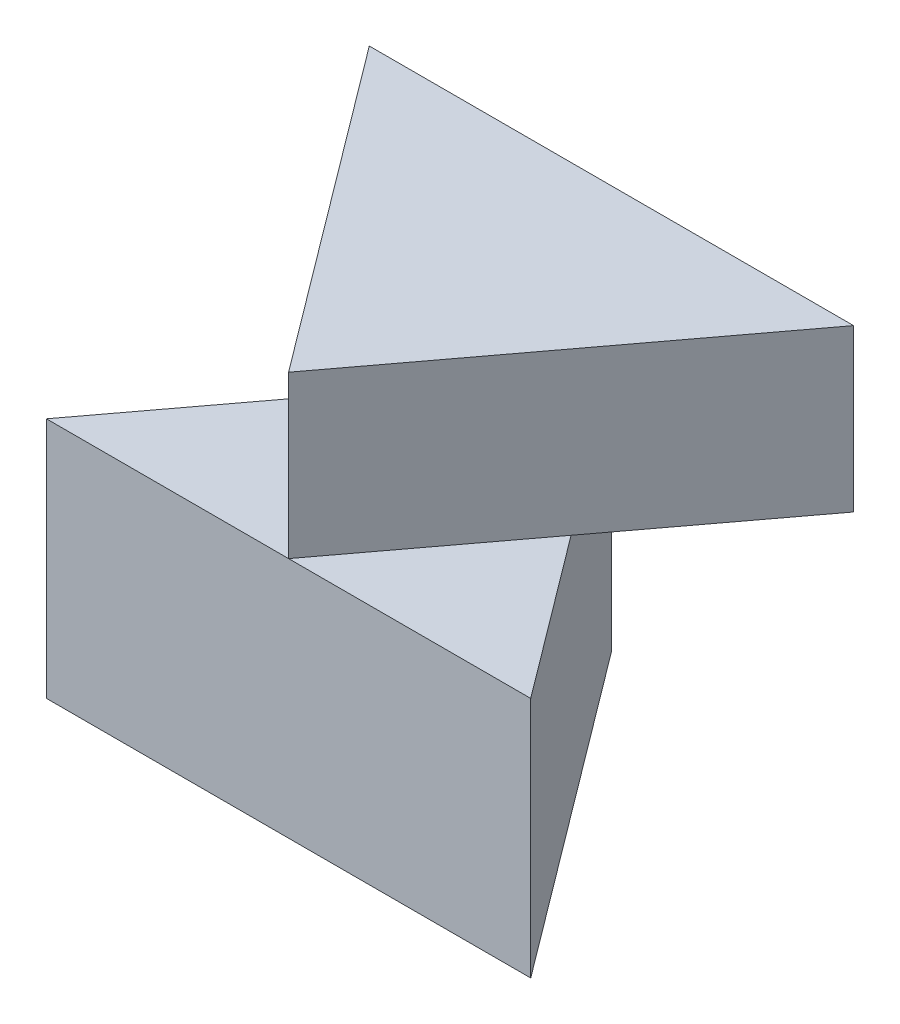
ISO-10303-21;
HEADER;
FILE_DESCRIPTION(('STEP AP214'),'2;1');
FILE_NAME('part.step','',(''),(''),'','','');
FILE_SCHEMA(('AUTOMOTIVE_DESIGN { 1 0 10303 214 1 1 1 1 }'));
ENDSEC;
DATA;
#1=APPLICATION_CONTEXT('core data for automotive mechanical design processes');
#2=APPLICATION_PROTOCOL_DEFINITION('international standard','automotive_design',2000,#1);
#3=PRODUCT_CONTEXT('',#1,'mechanical');
#4=PRODUCT('Part','Part','',(#3));
#5=PRODUCT_RELATED_PRODUCT_CATEGORY('part','',(#4));
#6=PRODUCT_DEFINITION_FORMATION('','',#4);
#7=PRODUCT_DEFINITION_CONTEXT('part definition',#1,'design');
#8=PRODUCT_DEFINITION('design','',#6,#7);
#9=PRODUCT_DEFINITION_SHAPE('','',#8);
#10=(LENGTH_UNIT() NAMED_UNIT(*) SI_UNIT(.MILLI.,.METRE.));
#11=(NAMED_UNIT(*) PLANE_ANGLE_UNIT() SI_UNIT($,.RADIAN.));
#12=(NAMED_UNIT(*) SI_UNIT($,.STERADIAN.) SOLID_ANGLE_UNIT());
#13=UNCERTAINTY_MEASURE_WITH_UNIT(LENGTH_MEASURE(1.E-05),#10,'distance_accuracy_value','');
#14=(GEOMETRIC_REPRESENTATION_CONTEXT(3) GLOBAL_UNCERTAINTY_ASSIGNED_CONTEXT((#13)) GLOBAL_UNIT_ASSIGNED_CONTEXT((#10,
#11,#12)) REPRESENTATION_CONTEXT('',''));
#15=CARTESIAN_POINT('',(0.,0.,0.));
#16=DIRECTION('',(0.,0.,1.));
#17=DIRECTION('',(1.,0.,0.));
#18=AXIS2_PLACEMENT_3D('',#15,#16,#17);
#19=CARTESIAN_POINT('',(0.,3.,0.));
#20=DIRECTION('',(0.,1.,0.));
#21=DIRECTION('',(0.,0.,1.));
#22=AXIS2_PLACEMENT_3D('',#19,#20,#21);
#23=PLANE('',#22);
#24=DIRECTION('',(0.6,0.,-0.8));
#25=VECTOR('',#24,1.);
#26=CARTESIAN_POINT('',(3.,3.,-4.));
#27=LINE('',#26,#25);
#28=CARTESIAN_POINT('',(0.,3.,0.));
#29=VERTEX_POINT('',#28);
#30=CARTESIAN_POINT('',(1.5,3.,-2.));
#31=VERTEX_POINT('',#30);
#32=EDGE_CURVE('E158',#29,#31,#27,.T.);
#33=ORIENTED_EDGE('',*,*,#32,.F.);
#34=DIRECTION('',(1.,0.,0.));
#35=VECTOR('',#34,1.);
#36=CARTESIAN_POINT('',(-3.,3.,0.));
#37=LINE('',#36,#35);
#38=CARTESIAN_POINT('',(3.,3.,0.));
#39=VERTEX_POINT('',#38);
#40=EDGE_CURVE('E133',#29,#39,#37,.T.);
#41=ORIENTED_EDGE('',*,*,#40,.T.);
#42=DIRECTION('',(-0.6,0.,-0.8));
#43=VECTOR('',#42,1.);
#44=CARTESIAN_POINT('',(3.,3.,0.));
#45=LINE('',#44,#43);
#46=EDGE_CURVE('E127',#39,#31,#45,.T.);
#47=ORIENTED_EDGE('',*,*,#46,.T.);
#48=EDGE_LOOP('',(#33,#41,#47));
#49=FACE_BOUND('',#48,.T.);
#50=ADVANCED_FACE('F33',(#49),#23,.T.);
#51=CARTESIAN_POINT('',(3.,3.,0.));
#52=DIRECTION('',(-0.8,0.,0.6));
#53=DIRECTION('',(0.6,0.,0.8));
#54=AXIS2_PLACEMENT_3D('',#51,#52,#53);
#55=PLANE('',#54);
#56=DIRECTION('',(-0.6,0.,-0.8));
#57=VECTOR('',#56,1.);
#58=CARTESIAN_POINT('',(3.,0.,0.));
#59=LINE('',#58,#57);
#60=CARTESIAN_POINT('',(3.,0.,0.));
#61=VERTEX_POINT('',#60);
#62=CARTESIAN_POINT('',(0.,0.,-4.));
#63=VERTEX_POINT('',#62);
#64=EDGE_CURVE('E118',#61,#63,#59,.T.);
#65=ORIENTED_EDGE('',*,*,#64,.T.);
#66=DIRECTION('',(0.,-1.,0.));
#67=VECTOR('',#66,1.);
#68=CARTESIAN_POINT('',(0.,3.,-4.));
#69=LINE('',#68,#67);
#70=CARTESIAN_POINT('',(0.,3.,-4.));
#71=VERTEX_POINT('',#70);
#72=EDGE_CURVE('E37',#71,#63,#69,.T.);
#73=ORIENTED_EDGE('',*,*,#72,.F.);
#74=EDGE_CURVE('E56',#31,#71,#45,.T.);
#75=ORIENTED_EDGE('',*,*,#74,.F.);
#76=ORIENTED_EDGE('',*,*,#46,.F.);
#77=DIRECTION('',(0.,-1.,0.));
#78=VECTOR('',#77,1.);
#79=CARTESIAN_POINT('',(3.,3.,0.));
#80=LINE('',#79,#78);
#81=EDGE_CURVE('E135',#39,#61,#80,.T.);
#82=ORIENTED_EDGE('',*,*,#81,.T.);
#83=EDGE_LOOP('',(#65,#73,#75,#76,#82));
#84=FACE_BOUND('',#83,.T.);
#85=ADVANCED_FACE('F35',(#84),#55,.F.);
#86=CARTESIAN_POINT('',(0.,3.,-4.));
#87=DIRECTION('',(0.8,0.,0.6));
#88=DIRECTION('',(0.6,0.,-0.8));
#89=AXIS2_PLACEMENT_3D('',#86,#87,#88);
#90=PLANE('',#89);
#91=DIRECTION('',(-0.6,0.,0.8));
#92=VECTOR('',#91,1.);
#93=CARTESIAN_POINT('',(0.,0.,-4.));
#94=LINE('',#93,#92);
#95=CARTESIAN_POINT('',(-3.,0.,0.));
#96=VERTEX_POINT('',#95);
#97=EDGE_CURVE('E121',#63,#96,#94,.T.);
#98=ORIENTED_EDGE('',*,*,#97,.T.);
#99=DIRECTION('',(0.,-1.,0.));
#100=VECTOR('',#99,1.);
#101=CARTESIAN_POINT('',(-3.,3.,0.));
#102=LINE('',#101,#100);
#103=CARTESIAN_POINT('',(-3.,3.,0.));
#104=VERTEX_POINT('',#103);
#105=EDGE_CURVE('E141',#104,#96,#102,.T.);
#106=ORIENTED_EDGE('',*,*,#105,.F.);
#107=DIRECTION('',(-0.6,0.,0.8));
#108=VECTOR('',#107,1.);
#109=CARTESIAN_POINT('',(0.,3.,-4.));
#110=LINE('',#109,#108);
#111=CARTESIAN_POINT('',(-1.5,3.,-2.));
#112=VERTEX_POINT('',#111);
#113=EDGE_CURVE('E129',#112,#104,#110,.T.);
#114=ORIENTED_EDGE('',*,*,#113,.F.);
#115=EDGE_CURVE('E130',#71,#112,#110,.T.);
#116=ORIENTED_EDGE('',*,*,#115,.F.);
#117=ORIENTED_EDGE('',*,*,#72,.T.);
#118=EDGE_LOOP('',(#98,#106,#114,#116,#117));
#119=FACE_BOUND('',#118,.T.);
#120=ADVANCED_FACE('F149',(#119),#90,.F.);
#121=CARTESIAN_POINT('',(-3.,3.,0.));
#122=DIRECTION('',(0.,0.,-1.));
#123=DIRECTION('',(-1.,0.,0.));
#124=AXIS2_PLACEMENT_3D('',#121,#122,#123);
#125=PLANE('',#124);
#126=DIRECTION('',(1.,0.,0.));
#127=VECTOR('',#126,1.);
#128=CARTESIAN_POINT('',(-3.,0.,0.));
#129=LINE('',#128,#127);
#130=EDGE_CURVE('E138',#96,#61,#129,.T.);
#131=ORIENTED_EDGE('',*,*,#130,.T.);
#132=ORIENTED_EDGE('',*,*,#81,.F.);
#133=ORIENTED_EDGE('',*,*,#40,.F.);
#134=EDGE_CURVE('E134',#104,#29,#37,.T.);
#135=ORIENTED_EDGE('',*,*,#134,.F.);
#136=ORIENTED_EDGE('',*,*,#105,.T.);
#137=EDGE_LOOP('',(#131,#132,#133,#135,#136));
#138=FACE_BOUND('',#137,.T.);
#139=ADVANCED_FACE('F154',(#138),#125,.F.);
#140=DIRECTION('',(0.6,0.,0.8));
#141=VECTOR('',#140,1.);
#142=CARTESIAN_POINT('',(0.,3.,0.));
#143=LINE('',#142,#141);
#144=EDGE_CURVE('E11',#112,#29,#143,.T.);
#145=ORIENTED_EDGE('',*,*,#144,.F.);
#146=ORIENTED_EDGE('',*,*,#113,.T.);
#147=ORIENTED_EDGE('',*,*,#134,.T.);
#148=EDGE_LOOP('',(#145,#146,#147));
#149=FACE_BOUND('',#148,.T.);
#150=ADVANCED_FACE('F183',(#149),#23,.T.);
#151=CARTESIAN_POINT('',(0.,0.,0.));
#152=DIRECTION('',(0.,1.,0.));
#153=DIRECTION('',(0.,0.,1.));
#154=AXIS2_PLACEMENT_3D('',#151,#152,#153);
#155=PLANE('',#154);
#156=ORIENTED_EDGE('',*,*,#64,.F.);
#157=ORIENTED_EDGE('',*,*,#130,.F.);
#158=ORIENTED_EDGE('',*,*,#97,.F.);
#159=EDGE_LOOP('',(#156,#157,#158));
#160=FACE_BOUND('',#159,.T.);
#161=ADVANCED_FACE('F153',(#160),#155,.F.);
#162=CARTESIAN_POINT('',(0.,3.,0.));
#163=DIRECTION('',(0.,-1.,0.));
#164=DIRECTION('',(0.,0.,-1.));
#165=AXIS2_PLACEMENT_3D('',#162,#163,#164);
#166=PLANE('',#165);
#167=CARTESIAN_POINT('',(3.,3.,-4.));
#168=VERTEX_POINT('',#167);
#169=EDGE_CURVE('E116',#31,#168,#27,.T.);
#170=ORIENTED_EDGE('',*,*,#169,.F.);
#171=ORIENTED_EDGE('',*,*,#74,.T.);
#172=DIRECTION('',(-1.,0.,0.));
#173=VECTOR('',#172,1.);
#174=CARTESIAN_POINT('',(-3.,3.,-4.));
#175=LINE('',#174,#173);
#176=EDGE_CURVE('E162',#168,#71,#175,.T.);
#177=ORIENTED_EDGE('',*,*,#176,.F.);
#178=EDGE_LOOP('',(#170,#171,#177));
#179=FACE_BOUND('',#178,.T.);
#180=ADVANCED_FACE('F160',(#179),#166,.T.);
#181=CARTESIAN_POINT('',(3.,5.,-4.));
#182=DIRECTION('',(-0.8,0.,-0.6));
#183=DIRECTION('',(-0.6,0.,0.8));
#184=AXIS2_PLACEMENT_3D('',#181,#182,#183);
#185=PLANE('',#184);
#186=ORIENTED_EDGE('',*,*,#32,.T.);
#187=ORIENTED_EDGE('',*,*,#169,.T.);
#188=DIRECTION('',(0.,-1.,0.));
#189=VECTOR('',#188,1.);
#190=CARTESIAN_POINT('',(3.,5.,-4.));
#191=LINE('',#190,#189);
#192=CARTESIAN_POINT('',(3.,5.,-4.));
#193=VERTEX_POINT('',#192);
#194=EDGE_CURVE('E99',#193,#168,#191,.T.);
#195=ORIENTED_EDGE('',*,*,#194,.F.);
#196=DIRECTION('',(0.6,0.,-0.8));
#197=VECTOR('',#196,1.);
#198=CARTESIAN_POINT('',(3.,5.,-4.));
#199=LINE('',#198,#197);
#200=CARTESIAN_POINT('',(0.,5.,0.));
#201=VERTEX_POINT('',#200);
#202=EDGE_CURVE('E105',#201,#193,#199,.T.);
#203=ORIENTED_EDGE('',*,*,#202,.F.);
#204=DIRECTION('',(0.,-1.,0.));
#205=VECTOR('',#204,1.);
#206=CARTESIAN_POINT('',(0.,5.,0.));
#207=LINE('',#206,#205);
#208=EDGE_CURVE('E123',#201,#29,#207,.T.);
#209=ORIENTED_EDGE('',*,*,#208,.T.);
#210=EDGE_LOOP('',(#186,#187,#195,#203,#209));
#211=FACE_BOUND('',#210,.T.);
#212=ADVANCED_FACE('F114',(#211),#185,.F.);
#213=CARTESIAN_POINT('',(-3.,5.,-4.));
#214=DIRECTION('',(0.,0.,1.));
#215=DIRECTION('',(1.,0.,0.));
#216=AXIS2_PLACEMENT_3D('',#213,#214,#215);
#217=PLANE('',#216);
#218=ORIENTED_EDGE('',*,*,#176,.T.);
#219=CARTESIAN_POINT('',(-3.,3.,-4.));
#220=VERTEX_POINT('',#219);
#221=EDGE_CURVE('E164',#71,#220,#175,.T.);
#222=ORIENTED_EDGE('',*,*,#221,.T.);
#223=DIRECTION('',(0.,-1.,0.));
#224=VECTOR('',#223,1.);
#225=CARTESIAN_POINT('',(-3.,5.,-4.));
#226=LINE('',#225,#224);
#227=CARTESIAN_POINT('',(-3.,5.,-4.));
#228=VERTEX_POINT('',#227);
#229=EDGE_CURVE('E101',#228,#220,#226,.T.);
#230=ORIENTED_EDGE('',*,*,#229,.F.);
#231=DIRECTION('',(-1.,0.,0.));
#232=VECTOR('',#231,1.);
#233=CARTESIAN_POINT('',(-3.,5.,-4.));
#234=LINE('',#233,#232);
#235=EDGE_CURVE('E94',#193,#228,#234,.T.);
#236=ORIENTED_EDGE('',*,*,#235,.F.);
#237=ORIENTED_EDGE('',*,*,#194,.T.);
#238=EDGE_LOOP('',(#218,#222,#230,#236,#237));
#239=FACE_BOUND('',#238,.T.);
#240=ADVANCED_FACE('F97',(#239),#217,.F.);
#241=CARTESIAN_POINT('',(0.,5.,0.));
#242=DIRECTION('',(0.8,0.,-0.6));
#243=DIRECTION('',(-0.6,0.,-0.8));
#244=AXIS2_PLACEMENT_3D('',#241,#242,#243);
#245=PLANE('',#244);
#246=EDGE_CURVE('E43',#220,#112,#143,.T.);
#247=ORIENTED_EDGE('',*,*,#246,.T.);
#248=ORIENTED_EDGE('',*,*,#144,.T.);
#249=ORIENTED_EDGE('',*,*,#208,.F.);
#250=DIRECTION('',(0.6,0.,0.8));
#251=VECTOR('',#250,1.);
#252=CARTESIAN_POINT('',(0.,5.,0.));
#253=LINE('',#252,#251);
#254=EDGE_CURVE('E104',#228,#201,#253,.T.);
#255=ORIENTED_EDGE('',*,*,#254,.F.);
#256=ORIENTED_EDGE('',*,*,#229,.T.);
#257=EDGE_LOOP('',(#247,#248,#249,#255,#256));
#258=FACE_BOUND('',#257,.T.);
#259=ADVANCED_FACE('F170',(#258),#245,.F.);
#260=CARTESIAN_POINT('',(0.,5.,0.));
#261=DIRECTION('',(0.,-1.,0.));
#262=DIRECTION('',(0.,0.,-1.));
#263=AXIS2_PLACEMENT_3D('',#260,#261,#262);
#264=PLANE('',#263);
#265=ORIENTED_EDGE('',*,*,#202,.T.);
#266=ORIENTED_EDGE('',*,*,#235,.T.);
#267=ORIENTED_EDGE('',*,*,#254,.T.);
#268=EDGE_LOOP('',(#265,#266,#267));
#269=FACE_BOUND('',#268,.T.);
#270=ADVANCED_FACE('F108',(#269),#264,.F.);
#271=ORIENTED_EDGE('',*,*,#221,.F.);
#272=ORIENTED_EDGE('',*,*,#115,.T.);
#273=ORIENTED_EDGE('',*,*,#246,.F.);
#274=EDGE_LOOP('',(#271,#272,#273));
#275=FACE_BOUND('',#274,.T.);
#276=ADVANCED_FACE('F172',(#275),#166,.T.);
#277=CLOSED_SHELL('',(#50,#85,#120,#139,#150,#161,#180,#212,#240,#259,#270,#276));
#278=MANIFOLD_SOLID_BREP('B2',#277);
#279=ADVANCED_BREP_SHAPE_REPRESENTATION('',(#18,#278),#14);
#280=SHAPE_DEFINITION_REPRESENTATION(#9,#279);
ENDSEC;
END-ISO-10303-21;
